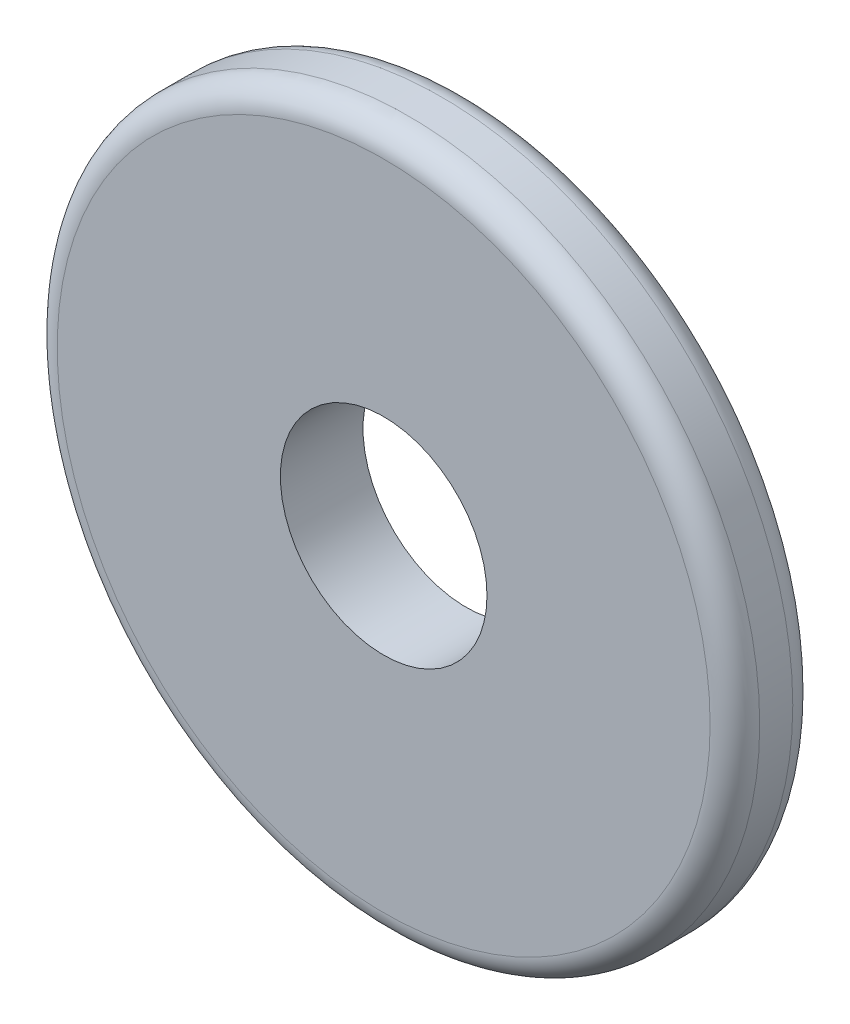
ISO-10303-21;
HEADER;
FILE_DESCRIPTION(('STEP AP214'),'2;1');
FILE_NAME('part.step','',(''),(''),'','','');
FILE_SCHEMA(('AUTOMOTIVE_DESIGN { 1 0 10303 214 1 1 1 1 }'));
ENDSEC;
DATA;
#1=APPLICATION_CONTEXT('core data for automotive mechanical design processes');
#2=APPLICATION_PROTOCOL_DEFINITION('international standard','automotive_design',2000,#1);
#3=PRODUCT_CONTEXT('',#1,'mechanical');
#4=PRODUCT('Part','Part','',(#3));
#5=PRODUCT_RELATED_PRODUCT_CATEGORY('part','',(#4));
#6=PRODUCT_DEFINITION_FORMATION('','',#4);
#7=PRODUCT_DEFINITION_CONTEXT('part definition',#1,'design');
#8=PRODUCT_DEFINITION('design','',#6,#7);
#9=PRODUCT_DEFINITION_SHAPE('','',#8);
#10=(LENGTH_UNIT() NAMED_UNIT(*) SI_UNIT(.MILLI.,.METRE.));
#11=(NAMED_UNIT(*) PLANE_ANGLE_UNIT() SI_UNIT($,.RADIAN.));
#12=(NAMED_UNIT(*) SI_UNIT($,.STERADIAN.) SOLID_ANGLE_UNIT());
#13=UNCERTAINTY_MEASURE_WITH_UNIT(LENGTH_MEASURE(1.E-05),#10,'distance_accuracy_value','');
#14=(GEOMETRIC_REPRESENTATION_CONTEXT(3) GLOBAL_UNCERTAINTY_ASSIGNED_CONTEXT((#13)) GLOBAL_UNIT_ASSIGNED_CONTEXT((#10,
#11,#12)) REPRESENTATION_CONTEXT('',''));
#15=CARTESIAN_POINT('',(0.,0.,0.));
#16=DIRECTION('',(0.,0.,1.));
#17=DIRECTION('',(1.,0.,0.));
#18=AXIS2_PLACEMENT_3D('',#15,#16,#17);
#19=CARTESIAN_POINT('',(0.,0.,10.));
#20=DIRECTION('',(0.,0.,1.));
#21=DIRECTION('',(1.,0.,0.));
#22=AXIS2_PLACEMENT_3D('',#19,#20,#21);
#23=PLANE('',#22);
#24=CARTESIAN_POINT('',(0.,0.,10.));
#25=DIRECTION('',(0.,0.,1.));
#26=DIRECTION('',(1.,0.,0.));
#27=AXIS2_PLACEMENT_3D('',#24,#25,#26);
#28=CIRCLE('',#27,39.5);
#29=CARTESIAN_POINT('',(39.5,0.,10.));
#30=VERTEX_POINT('',#29);
#31=EDGE_CURVE('E10',#30,#30,#28,.T.);
#32=ORIENTED_EDGE('',*,*,#31,.T.);
#33=EDGE_LOOP('',(#32));
#34=FACE_BOUND('',#33,.T.);
#35=CARTESIAN_POINT('',(0.,0.,10.));
#36=DIRECTION('',(0.,0.,1.));
#37=DIRECTION('',(1.,0.,0.));
#38=AXIS2_PLACEMENT_3D('',#35,#36,#37);
#39=CIRCLE('',#38,12.5);
#40=CARTESIAN_POINT('',(12.5,0.,10.));
#41=VERTEX_POINT('',#40);
#42=EDGE_CURVE('E51',#41,#41,#39,.T.);
#43=ORIENTED_EDGE('',*,*,#42,.F.);
#44=EDGE_LOOP('',(#43));
#45=FACE_BOUND('',#44,.T.);
#46=ADVANCED_FACE('F31',(#34,#45),#23,.T.);
#47=CARTESIAN_POINT('',(0.,0.,0.));
#48=DIRECTION('',(0.,0.,1.));
#49=DIRECTION('',(1.,0.,0.));
#50=AXIS2_PLACEMENT_3D('',#47,#48,#49);
#51=PLANE('',#50);
#52=CARTESIAN_POINT('',(0.,0.,0.));
#53=DIRECTION('',(0.,0.,1.));
#54=DIRECTION('',(1.,0.,0.));
#55=AXIS2_PLACEMENT_3D('',#52,#53,#54);
#56=CIRCLE('',#55,39.5);
#57=CARTESIAN_POINT('',(39.5,0.,0.));
#58=VERTEX_POINT('',#57);
#59=EDGE_CURVE('E38',#58,#58,#56,.F.);
#60=ORIENTED_EDGE('',*,*,#59,.T.);
#61=EDGE_LOOP('',(#60));
#62=FACE_BOUND('',#61,.T.);
#63=CARTESIAN_POINT('',(0.,0.,0.));
#64=DIRECTION('',(0.,0.,1.));
#65=DIRECTION('',(1.,0.,0.));
#66=AXIS2_PLACEMENT_3D('',#63,#64,#65);
#67=CIRCLE('',#66,12.5);
#68=CARTESIAN_POINT('',(12.5,0.,0.));
#69=VERTEX_POINT('',#68);
#70=EDGE_CURVE('E52',#69,#69,#67,.T.);
#71=ORIENTED_EDGE('',*,*,#70,.T.);
#72=EDGE_LOOP('',(#71));
#73=FACE_BOUND('',#72,.T.);
#74=ADVANCED_FACE('F62',(#62,#73),#51,.F.);
#75=CARTESIAN_POINT('',(0.,0.,10.));
#76=DIRECTION('',(0.,0.,-1.));
#77=DIRECTION('',(-1.,0.,0.));
#78=AXIS2_PLACEMENT_3D('',#75,#76,#77);
#79=CYLINDRICAL_SURFACE('',#78,42.5);
#80=CARTESIAN_POINT('',(0.,0.,3.));
#81=DIRECTION('',(0.,0.,1.));
#82=DIRECTION('',(1.,0.,0.));
#83=AXIS2_PLACEMENT_3D('',#80,#81,#82);
#84=CIRCLE('',#83,42.5);
#85=CARTESIAN_POINT('',(42.5,0.,3.));
#86=VERTEX_POINT('',#85);
#87=EDGE_CURVE('E42',#86,#86,#84,.T.);
#88=ORIENTED_EDGE('',*,*,#87,.T.);
#89=EDGE_LOOP('',(#88));
#90=FACE_BOUND('',#89,.T.);
#91=CARTESIAN_POINT('',(0.,0.,7.));
#92=DIRECTION('',(0.,0.,1.));
#93=DIRECTION('',(1.,0.,0.));
#94=AXIS2_PLACEMENT_3D('',#91,#92,#93);
#95=CIRCLE('',#94,42.5);
#96=CARTESIAN_POINT('',(42.5,0.,7.));
#97=VERTEX_POINT('',#96);
#98=EDGE_CURVE('E46',#97,#97,#95,.F.);
#99=ORIENTED_EDGE('',*,*,#98,.T.);
#100=EDGE_LOOP('',(#99));
#101=FACE_BOUND('',#100,.T.);
#102=ADVANCED_FACE('F67',(#90,#101),#79,.T.);
#103=CARTESIAN_POINT('',(0.,0.,10.));
#104=DIRECTION('',(0.,0.,-1.));
#105=DIRECTION('',(-1.,0.,0.));
#106=AXIS2_PLACEMENT_3D('',#103,#104,#105);
#107=CYLINDRICAL_SURFACE('',#106,12.5);
#108=ORIENTED_EDGE('',*,*,#42,.T.);
#109=EDGE_LOOP('',(#108));
#110=FACE_BOUND('',#109,.T.);
#111=ORIENTED_EDGE('',*,*,#70,.F.);
#112=EDGE_LOOP('',(#111));
#113=FACE_BOUND('',#112,.T.);
#114=ADVANCED_FACE('F58',(#110,#113),#107,.F.);
#115=CARTESIAN_POINT('',(0.,0.,3.));
#116=DIRECTION('',(0.,0.,1.));
#117=DIRECTION('',(1.,0.,0.));
#118=AXIS2_PLACEMENT_3D('',#115,#116,#117);
#119=TOROIDAL_SURFACE('',#118,39.5,3.);
#120=ORIENTED_EDGE('',*,*,#59,.F.);
#121=EDGE_LOOP('',(#120));
#122=FACE_BOUND('',#121,.T.);
#123=ORIENTED_EDGE('',*,*,#87,.F.);
#124=EDGE_LOOP('',(#123));
#125=FACE_BOUND('',#124,.T.);
#126=ADVANCED_FACE('F73',(#122,#125),#119,.T.);
#127=CARTESIAN_POINT('',(0.,0.,7.));
#128=DIRECTION('',(0.,0.,1.));
#129=DIRECTION('',(1.,0.,0.));
#130=AXIS2_PLACEMENT_3D('',#127,#128,#129);
#131=TOROIDAL_SURFACE('',#130,39.5,3.);
#132=ORIENTED_EDGE('',*,*,#98,.F.);
#133=EDGE_LOOP('',(#132));
#134=FACE_BOUND('',#133,.T.);
#135=ORIENTED_EDGE('',*,*,#31,.F.);
#136=EDGE_LOOP('',(#135));
#137=FACE_BOUND('',#136,.T.);
#138=ADVANCED_FACE('F33',(#134,#137),#131,.T.);
#139=CLOSED_SHELL('',(#46,#74,#102,#114,#126,#138));
#140=MANIFOLD_SOLID_BREP('B2',#139);
#141=ADVANCED_BREP_SHAPE_REPRESENTATION('',(#18,#140),#14);
#142=SHAPE_DEFINITION_REPRESENTATION(#9,#141);
ENDSEC;
END-ISO-10303-21;
